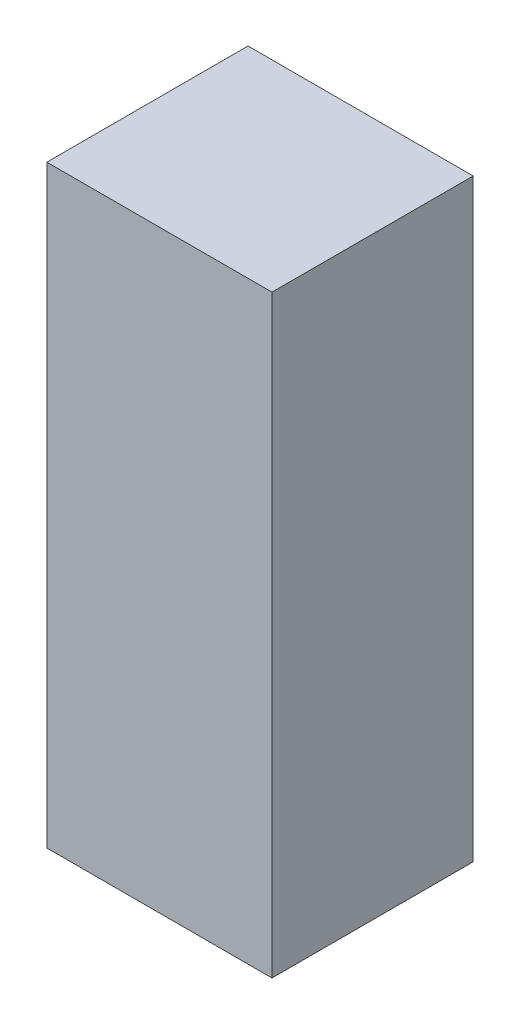
ISO-10303-21;
HEADER;
FILE_DESCRIPTION(('STEP AP214'),'2;1');
FILE_NAME('part.step','',(''),(''),'','','');
FILE_SCHEMA(('AUTOMOTIVE_DESIGN { 1 0 10303 214 1 1 1 1 }'));
ENDSEC;
DATA;
#1=APPLICATION_CONTEXT('core data for automotive mechanical design processes');
#2=APPLICATION_PROTOCOL_DEFINITION('international standard','automotive_design',2000,#1);
#3=PRODUCT_CONTEXT('',#1,'mechanical');
#4=PRODUCT('Part','Part','',(#3));
#5=PRODUCT_RELATED_PRODUCT_CATEGORY('part','',(#4));
#6=PRODUCT_DEFINITION_FORMATION('','',#4);
#7=PRODUCT_DEFINITION_CONTEXT('part definition',#1,'design');
#8=PRODUCT_DEFINITION('design','',#6,#7);
#9=PRODUCT_DEFINITION_SHAPE('','',#8);
#10=(LENGTH_UNIT() NAMED_UNIT(*) SI_UNIT(.MILLI.,.METRE.));
#11=(NAMED_UNIT(*) PLANE_ANGLE_UNIT() SI_UNIT($,.RADIAN.));
#12=(NAMED_UNIT(*) SI_UNIT($,.STERADIAN.) SOLID_ANGLE_UNIT());
#13=UNCERTAINTY_MEASURE_WITH_UNIT(LENGTH_MEASURE(1.E-05),#10,'distance_accuracy_value','');
#14=(GEOMETRIC_REPRESENTATION_CONTEXT(3) GLOBAL_UNCERTAINTY_ASSIGNED_CONTEXT((#13)) GLOBAL_UNIT_ASSIGNED_CONTEXT((#10,
#11,#12)) REPRESENTATION_CONTEXT('',''));
#15=CARTESIAN_POINT('',(0.,0.,0.));
#16=DIRECTION('',(0.,0.,1.));
#17=DIRECTION('',(1.,0.,0.));
#18=AXIS2_PLACEMENT_3D('',#15,#16,#17);
#19=CARTESIAN_POINT('',(0.,1574.8,0.));
#20=DIRECTION('',(1.,0.,0.));
#21=DIRECTION('',(0.,0.,-1.));
#22=AXIS2_PLACEMENT_3D('',#19,#20,#21);
#23=PLANE('',#22);
#24=DIRECTION('',(0.,0.,1.));
#25=VECTOR('',#24,1.);
#26=CARTESIAN_POINT('',(0.,0.,0.));
#27=LINE('',#26,#25);
#28=CARTESIAN_POINT('',(0.,0.,-533.4));
#29=VERTEX_POINT('',#28);
#30=CARTESIAN_POINT('',(0.,0.,0.));
#31=VERTEX_POINT('',#30);
#32=EDGE_CURVE('E98',#29,#31,#27,.T.);
#33=ORIENTED_EDGE('',*,*,#32,.T.);
#34=DIRECTION('',(0.,-1.,0.));
#35=VECTOR('',#34,1.);
#36=CARTESIAN_POINT('',(0.,1574.8,0.));
#37=LINE('',#36,#35);
#38=CARTESIAN_POINT('',(0.,1574.8,0.));
#39=VERTEX_POINT('',#38);
#40=EDGE_CURVE('E11',#39,#31,#37,.T.);
#41=ORIENTED_EDGE('',*,*,#40,.F.);
#42=DIRECTION('',(0.,0.,1.));
#43=VECTOR('',#42,1.);
#44=CARTESIAN_POINT('',(0.,1574.8,0.));
#45=LINE('',#44,#43);
#46=CARTESIAN_POINT('',(0.,1574.8,-533.4));
#47=VERTEX_POINT('',#46);
#48=EDGE_CURVE('E86',#47,#39,#45,.T.);
#49=ORIENTED_EDGE('',*,*,#48,.F.);
#50=DIRECTION('',(0.,-1.,0.));
#51=VECTOR('',#50,1.);
#52=CARTESIAN_POINT('',(0.,1574.8,-533.4));
#53=LINE('',#52,#51);
#54=EDGE_CURVE('E94',#47,#29,#53,.T.);
#55=ORIENTED_EDGE('',*,*,#54,.T.);
#56=EDGE_LOOP('',(#33,#41,#49,#55));
#57=FACE_BOUND('',#56,.T.);
#58=ADVANCED_FACE('F35',(#57),#23,.F.);
#59=CARTESIAN_POINT('',(0.,1574.8,0.));
#60=DIRECTION('',(0.,0.,-1.));
#61=DIRECTION('',(-1.,0.,0.));
#62=AXIS2_PLACEMENT_3D('',#59,#60,#61);
#63=PLANE('',#62);
#64=DIRECTION('',(1.,0.,0.));
#65=VECTOR('',#64,1.);
#66=CARTESIAN_POINT('',(0.,0.,0.));
#67=LINE('',#66,#65);
#68=CARTESIAN_POINT('',(596.9,0.,0.));
#69=VERTEX_POINT('',#68);
#70=EDGE_CURVE('E90',#31,#69,#67,.T.);
#71=ORIENTED_EDGE('',*,*,#70,.T.);
#72=DIRECTION('',(0.,-1.,0.));
#73=VECTOR('',#72,1.);
#74=CARTESIAN_POINT('',(596.9,1574.8,0.));
#75=LINE('',#74,#73);
#76=CARTESIAN_POINT('',(596.9,1574.8,0.));
#77=VERTEX_POINT('',#76);
#78=EDGE_CURVE('E43',#77,#69,#75,.T.);
#79=ORIENTED_EDGE('',*,*,#78,.F.);
#80=DIRECTION('',(1.,0.,0.));
#81=VECTOR('',#80,1.);
#82=CARTESIAN_POINT('',(0.,1574.8,0.));
#83=LINE('',#82,#81);
#84=EDGE_CURVE('E81',#39,#77,#83,.T.);
#85=ORIENTED_EDGE('',*,*,#84,.F.);
#86=ORIENTED_EDGE('',*,*,#40,.T.);
#87=EDGE_LOOP('',(#71,#79,#85,#86));
#88=FACE_BOUND('',#87,.T.);
#89=ADVANCED_FACE('F89',(#88),#63,.F.);
#90=CARTESIAN_POINT('',(596.9,1574.8,0.));
#91=DIRECTION('',(-1.,0.,0.));
#92=DIRECTION('',(0.,0.,1.));
#93=AXIS2_PLACEMENT_3D('',#90,#91,#92);
#94=PLANE('',#93);
#95=DIRECTION('',(0.,0.,-1.));
#96=VECTOR('',#95,1.);
#97=CARTESIAN_POINT('',(596.9,0.,0.));
#98=LINE('',#97,#96);
#99=CARTESIAN_POINT('',(596.9,0.,-533.4));
#100=VERTEX_POINT('',#99);
#101=EDGE_CURVE('E68',#69,#100,#98,.T.);
#102=ORIENTED_EDGE('',*,*,#101,.T.);
#103=DIRECTION('',(0.,-1.,0.));
#104=VECTOR('',#103,1.);
#105=CARTESIAN_POINT('',(596.9,1574.8,-533.4));
#106=LINE('',#105,#104);
#107=CARTESIAN_POINT('',(596.9,1574.8,-533.4));
#108=VERTEX_POINT('',#107);
#109=EDGE_CURVE('E91',#108,#100,#106,.T.);
#110=ORIENTED_EDGE('',*,*,#109,.F.);
#111=DIRECTION('',(0.,0.,-1.));
#112=VECTOR('',#111,1.);
#113=CARTESIAN_POINT('',(596.9,1574.8,0.));
#114=LINE('',#113,#112);
#115=EDGE_CURVE('E84',#77,#108,#114,.T.);
#116=ORIENTED_EDGE('',*,*,#115,.F.);
#117=ORIENTED_EDGE('',*,*,#78,.T.);
#118=EDGE_LOOP('',(#102,#110,#116,#117));
#119=FACE_BOUND('',#118,.T.);
#120=ADVANCED_FACE('F92',(#119),#94,.F.);
#121=CARTESIAN_POINT('',(0.,1574.8,-533.4));
#122=DIRECTION('',(0.,0.,1.));
#123=DIRECTION('',(1.,0.,0.));
#124=AXIS2_PLACEMENT_3D('',#121,#122,#123);
#125=PLANE('',#124);
#126=DIRECTION('',(-1.,0.,0.));
#127=VECTOR('',#126,1.);
#128=CARTESIAN_POINT('',(0.,0.,-533.4));
#129=LINE('',#128,#127);
#130=EDGE_CURVE('E74',#100,#29,#129,.T.);
#131=ORIENTED_EDGE('',*,*,#130,.T.);
#132=ORIENTED_EDGE('',*,*,#54,.F.);
#133=DIRECTION('',(-1.,0.,0.));
#134=VECTOR('',#133,1.);
#135=CARTESIAN_POINT('',(0.,1574.8,-533.4));
#136=LINE('',#135,#134);
#137=EDGE_CURVE('E51',#108,#47,#136,.T.);
#138=ORIENTED_EDGE('',*,*,#137,.F.);
#139=ORIENTED_EDGE('',*,*,#109,.T.);
#140=EDGE_LOOP('',(#131,#132,#138,#139));
#141=FACE_BOUND('',#140,.T.);
#142=ADVANCED_FACE('F105',(#141),#125,.F.);
#143=CARTESIAN_POINT('',(0.,1574.8,0.));
#144=DIRECTION('',(0.,-1.,0.));
#145=DIRECTION('',(0.,0.,-1.));
#146=AXIS2_PLACEMENT_3D('',#143,#144,#145);
#147=PLANE('',#146);
#148=ORIENTED_EDGE('',*,*,#48,.T.);
#149=ORIENTED_EDGE('',*,*,#84,.T.);
#150=ORIENTED_EDGE('',*,*,#115,.T.);
#151=ORIENTED_EDGE('',*,*,#137,.T.);
#152=EDGE_LOOP('',(#148,#149,#150,#151));
#153=FACE_BOUND('',#152,.T.);
#154=ADVANCED_FACE('F82',(#153),#147,.F.);
#155=CARTESIAN_POINT('',(0.,0.,0.));
#156=DIRECTION('',(0.,-1.,0.));
#157=DIRECTION('',(0.,0.,-1.));
#158=AXIS2_PLACEMENT_3D('',#155,#156,#157);
#159=PLANE('',#158);
#160=ORIENTED_EDGE('',*,*,#32,.F.);
#161=ORIENTED_EDGE('',*,*,#130,.F.);
#162=ORIENTED_EDGE('',*,*,#101,.F.);
#163=ORIENTED_EDGE('',*,*,#70,.F.);
#164=EDGE_LOOP('',(#160,#161,#162,#163));
#165=FACE_BOUND('',#164,.T.);
#166=ADVANCED_FACE('F108',(#165),#159,.T.);
#167=CLOSED_SHELL('',(#58,#89,#120,#142,#154,#166));
#168=MANIFOLD_SOLID_BREP('B2',#167);
#169=ADVANCED_BREP_SHAPE_REPRESENTATION('',(#18,#168),#14);
#170=SHAPE_DEFINITION_REPRESENTATION(#9,#169);
ENDSEC;
END-ISO-10303-21;
